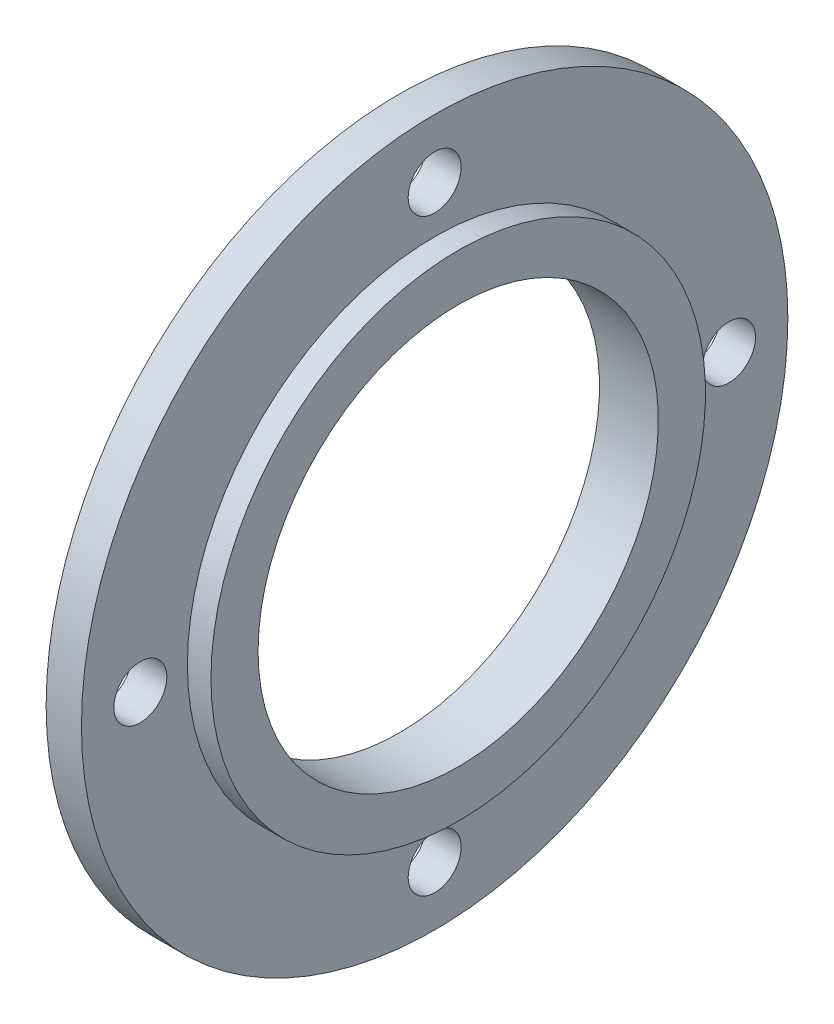
ISO-10303-21;
HEADER;
FILE_DESCRIPTION(('STEP AP214'),'2;1');
FILE_NAME('part.step','',(''),(''),'','','');
FILE_SCHEMA(('AUTOMOTIVE_DESIGN { 1 0 10303 214 1 1 1 1 }'));
ENDSEC;
DATA;
#1=APPLICATION_CONTEXT('core data for automotive mechanical design processes');
#2=APPLICATION_PROTOCOL_DEFINITION('international standard','automotive_design',2000,#1);
#3=PRODUCT_CONTEXT('',#1,'mechanical');
#4=PRODUCT('Part','Part','',(#3));
#5=PRODUCT_RELATED_PRODUCT_CATEGORY('part','',(#4));
#6=PRODUCT_DEFINITION_FORMATION('','',#4);
#7=PRODUCT_DEFINITION_CONTEXT('part definition',#1,'design');
#8=PRODUCT_DEFINITION('design','',#6,#7);
#9=PRODUCT_DEFINITION_SHAPE('','',#8);
#10=(LENGTH_UNIT() NAMED_UNIT(*) SI_UNIT(.MILLI.,.METRE.));
#11=(NAMED_UNIT(*) PLANE_ANGLE_UNIT() SI_UNIT($,.RADIAN.));
#12=(NAMED_UNIT(*) SI_UNIT($,.STERADIAN.) SOLID_ANGLE_UNIT());
#13=UNCERTAINTY_MEASURE_WITH_UNIT(LENGTH_MEASURE(1.E-05),#10,'distance_accuracy_value','');
#14=(GEOMETRIC_REPRESENTATION_CONTEXT(3) GLOBAL_UNCERTAINTY_ASSIGNED_CONTEXT((#13)) GLOBAL_UNIT_ASSIGNED_CONTEXT((#10,
#11,#12)) REPRESENTATION_CONTEXT('',''));
#15=CARTESIAN_POINT('',(0.,0.,0.));
#16=DIRECTION('',(0.,0.,1.));
#17=DIRECTION('',(1.,0.,0.));
#18=AXIS2_PLACEMENT_3D('',#15,#16,#17);
#19=CARTESIAN_POINT('',(0.,30.,0.));
#20=DIRECTION('',(1.,0.,0.));
#21=DIRECTION('',(0.,0.,-1.));
#22=AXIS2_PLACEMENT_3D('',#19,#20,#21);
#23=PLANE('',#22);
#24=CARTESIAN_POINT('',(0.,2.61861100413235E-13,25.));
#25=DIRECTION('',(-1.,0.,0.));
#26=DIRECTION('',(0.,0.,1.));
#27=AXIS2_PLACEMENT_3D('',#24,#25,#26);
#28=CIRCLE('',#27,2.25);
#29=CARTESIAN_POINT('',(0.,2.61861100413235E-13,27.25));
#30=VERTEX_POINT('',#29);
#31=EDGE_CURVE('E78',#30,#30,#28,.T.);
#32=ORIENTED_EDGE('',*,*,#31,.F.);
#33=EDGE_LOOP('',(#32));
#34=FACE_BOUND('',#33,.T.);
#35=CARTESIAN_POINT('',(0.,-25.,0.));
#36=DIRECTION('',(-1.,0.,0.));
#37=DIRECTION('',(0.,0.,1.));
#38=AXIS2_PLACEMENT_3D('',#35,#36,#37);
#39=CIRCLE('',#38,2.25);
#40=CARTESIAN_POINT('',(0.,-25.,2.25));
#41=VERTEX_POINT('',#40);
#42=EDGE_CURVE('E72',#41,#41,#39,.T.);
#43=ORIENTED_EDGE('',*,*,#42,.F.);
#44=EDGE_LOOP('',(#43));
#45=FACE_BOUND('',#44,.T.);
#46=CARTESIAN_POINT('',(0.,0.,-25.));
#47=DIRECTION('',(-1.,0.,0.));
#48=DIRECTION('',(0.,0.,1.));
#49=AXIS2_PLACEMENT_3D('',#46,#47,#48);
#50=CIRCLE('',#49,2.25);
#51=CARTESIAN_POINT('',(0.,0.,-22.75));
#52=VERTEX_POINT('',#51);
#53=EDGE_CURVE('E66',#52,#52,#50,.T.);
#54=ORIENTED_EDGE('',*,*,#53,.F.);
#55=EDGE_LOOP('',(#54));
#56=FACE_BOUND('',#55,.T.);
#57=CARTESIAN_POINT('',(0.,25.,0.));
#58=DIRECTION('',(-1.,0.,0.));
#59=DIRECTION('',(0.,0.,1.));
#60=AXIS2_PLACEMENT_3D('',#57,#58,#59);
#61=CIRCLE('',#60,2.25);
#62=CARTESIAN_POINT('',(0.,25.,2.25));
#63=VERTEX_POINT('',#62);
#64=EDGE_CURVE('E60',#63,#63,#61,.T.);
#65=ORIENTED_EDGE('',*,*,#64,.F.);
#66=EDGE_LOOP('',(#65));
#67=FACE_BOUND('',#66,.T.);
#68=CARTESIAN_POINT('',(0.,0.,0.));
#69=DIRECTION('',(-1.,0.,0.));
#70=DIRECTION('',(0.,0.,1.));
#71=AXIS2_PLACEMENT_3D('',#68,#69,#70);
#72=CIRCLE('',#71,17.);
#73=CARTESIAN_POINT('',(0.,0.,17.));
#74=VERTEX_POINT('',#73);
#75=EDGE_CURVE('E10',#74,#74,#72,.T.);
#76=ORIENTED_EDGE('',*,*,#75,.F.);
#77=EDGE_LOOP('',(#76));
#78=FACE_BOUND('',#77,.T.);
#79=CARTESIAN_POINT('',(0.,0.,0.));
#80=DIRECTION('',(-1.,0.,0.));
#81=DIRECTION('',(0.,0.,1.));
#82=AXIS2_PLACEMENT_3D('',#79,#80,#81);
#83=CIRCLE('',#82,30.);
#84=CARTESIAN_POINT('',(0.,0.,30.));
#85=VERTEX_POINT('',#84);
#86=EDGE_CURVE('E54',#85,#85,#83,.T.);
#87=ORIENTED_EDGE('',*,*,#86,.T.);
#88=EDGE_LOOP('',(#87));
#89=FACE_BOUND('',#88,.T.);
#90=ADVANCED_FACE('F32',(#34,#45,#56,#67,#78,#89),#23,.F.);
#91=CARTESIAN_POINT('',(0.,0.,0.));
#92=DIRECTION('',(-1.,0.,0.));
#93=DIRECTION('',(0.,0.,1.));
#94=AXIS2_PLACEMENT_3D('',#91,#92,#93);
#95=CYLINDRICAL_SURFACE('',#94,17.);
#96=CARTESIAN_POINT('',(5.,0.,0.));
#97=DIRECTION('',(-1.,0.,0.));
#98=DIRECTION('',(0.,0.,1.));
#99=AXIS2_PLACEMENT_3D('',#96,#97,#98);
#100=CIRCLE('',#99,17.);
#101=CARTESIAN_POINT('',(5.,0.,17.));
#102=VERTEX_POINT('',#101);
#103=EDGE_CURVE('E38',#102,#102,#100,.T.);
#104=ORIENTED_EDGE('',*,*,#103,.F.);
#105=EDGE_LOOP('',(#104));
#106=FACE_BOUND('',#105,.T.);
#107=ORIENTED_EDGE('',*,*,#75,.T.);
#108=EDGE_LOOP('',(#107));
#109=FACE_BOUND('',#108,.T.);
#110=ADVANCED_FACE('F86',(#106,#109),#95,.F.);
#111=CARTESIAN_POINT('',(5.,17.,0.));
#112=DIRECTION('',(-1.,0.,0.));
#113=DIRECTION('',(0.,0.,1.));
#114=AXIS2_PLACEMENT_3D('',#111,#112,#113);
#115=PLANE('',#114);
#116=CARTESIAN_POINT('',(5.,0.,0.));
#117=DIRECTION('',(-1.,0.,0.));
#118=DIRECTION('',(0.,0.,1.));
#119=AXIS2_PLACEMENT_3D('',#116,#117,#118);
#120=CIRCLE('',#119,21.);
#121=CARTESIAN_POINT('',(5.,0.,21.));
#122=VERTEX_POINT('',#121);
#123=EDGE_CURVE('E42',#122,#122,#120,.T.);
#124=ORIENTED_EDGE('',*,*,#123,.F.);
#125=EDGE_LOOP('',(#124));
#126=FACE_BOUND('',#125,.T.);
#127=ORIENTED_EDGE('',*,*,#103,.T.);
#128=EDGE_LOOP('',(#127));
#129=FACE_BOUND('',#128,.T.);
#130=ADVANCED_FACE('F113',(#126,#129),#115,.F.);
#131=CARTESIAN_POINT('',(0.,0.,0.));
#132=DIRECTION('',(-1.,0.,0.));
#133=DIRECTION('',(0.,0.,1.));
#134=AXIS2_PLACEMENT_3D('',#131,#132,#133);
#135=CYLINDRICAL_SURFACE('',#134,21.);
#136=CARTESIAN_POINT('',(3.,0.,0.));
#137=DIRECTION('',(-1.,0.,0.));
#138=DIRECTION('',(0.,0.,1.));
#139=AXIS2_PLACEMENT_3D('',#136,#137,#138);
#140=CIRCLE('',#139,21.);
#141=CARTESIAN_POINT('',(3.,0.,21.));
#142=VERTEX_POINT('',#141);
#143=EDGE_CURVE('E46',#142,#142,#140,.T.);
#144=ORIENTED_EDGE('',*,*,#143,.F.);
#145=EDGE_LOOP('',(#144));
#146=FACE_BOUND('',#145,.T.);
#147=ORIENTED_EDGE('',*,*,#123,.T.);
#148=EDGE_LOOP('',(#147));
#149=FACE_BOUND('',#148,.T.);
#150=ADVANCED_FACE('F106',(#146,#149),#135,.T.);
#151=CARTESIAN_POINT('',(3.,21.,0.));
#152=DIRECTION('',(-1.,0.,0.));
#153=DIRECTION('',(0.,0.,1.));
#154=AXIS2_PLACEMENT_3D('',#151,#152,#153);
#155=PLANE('',#154);
#156=CARTESIAN_POINT('',(3.,2.61861100413235E-13,25.));
#157=DIRECTION('',(-1.,0.,0.));
#158=DIRECTION('',(0.,0.,1.));
#159=AXIS2_PLACEMENT_3D('',#156,#157,#158);
#160=CIRCLE('',#159,2.25);
#161=CARTESIAN_POINT('',(3.,2.61861100413235E-13,27.25));
#162=VERTEX_POINT('',#161);
#163=EDGE_CURVE('E75',#162,#162,#160,.T.);
#164=ORIENTED_EDGE('',*,*,#163,.T.);
#165=EDGE_LOOP('',(#164));
#166=FACE_BOUND('',#165,.T.);
#167=CARTESIAN_POINT('',(3.,-25.,0.));
#168=DIRECTION('',(-1.,0.,0.));
#169=DIRECTION('',(0.,0.,1.));
#170=AXIS2_PLACEMENT_3D('',#167,#168,#169);
#171=CIRCLE('',#170,2.25);
#172=CARTESIAN_POINT('',(3.,-25.,2.25));
#173=VERTEX_POINT('',#172);
#174=EDGE_CURVE('E69',#173,#173,#171,.T.);
#175=ORIENTED_EDGE('',*,*,#174,.T.);
#176=EDGE_LOOP('',(#175));
#177=FACE_BOUND('',#176,.T.);
#178=CARTESIAN_POINT('',(3.,0.,-25.));
#179=DIRECTION('',(-1.,0.,0.));
#180=DIRECTION('',(0.,0.,1.));
#181=AXIS2_PLACEMENT_3D('',#178,#179,#180);
#182=CIRCLE('',#181,2.25);
#183=CARTESIAN_POINT('',(3.,0.,-22.75));
#184=VERTEX_POINT('',#183);
#185=EDGE_CURVE('E63',#184,#184,#182,.T.);
#186=ORIENTED_EDGE('',*,*,#185,.T.);
#187=EDGE_LOOP('',(#186));
#188=FACE_BOUND('',#187,.T.);
#189=CARTESIAN_POINT('',(3.,25.,0.));
#190=DIRECTION('',(-1.,0.,0.));
#191=DIRECTION('',(0.,0.,1.));
#192=AXIS2_PLACEMENT_3D('',#189,#190,#191);
#193=CIRCLE('',#192,2.25);
#194=CARTESIAN_POINT('',(3.,25.,2.25));
#195=VERTEX_POINT('',#194);
#196=EDGE_CURVE('E57',#195,#195,#193,.T.);
#197=ORIENTED_EDGE('',*,*,#196,.T.);
#198=EDGE_LOOP('',(#197));
#199=FACE_BOUND('',#198,.T.);
#200=CARTESIAN_POINT('',(3.,0.,0.));
#201=DIRECTION('',(-1.,0.,0.));
#202=DIRECTION('',(0.,0.,1.));
#203=AXIS2_PLACEMENT_3D('',#200,#201,#202);
#204=CIRCLE('',#203,30.);
#205=CARTESIAN_POINT('',(3.,0.,30.));
#206=VERTEX_POINT('',#205);
#207=EDGE_CURVE('E51',#206,#206,#204,.T.);
#208=ORIENTED_EDGE('',*,*,#207,.F.);
#209=EDGE_LOOP('',(#208));
#210=FACE_BOUND('',#209,.T.);
#211=ORIENTED_EDGE('',*,*,#143,.T.);
#212=EDGE_LOOP('',(#211));
#213=FACE_BOUND('',#212,.T.);
#214=ADVANCED_FACE('F100',(#166,#177,#188,#199,#210,#213),#155,.F.);
#215=CARTESIAN_POINT('',(0.,0.,0.));
#216=DIRECTION('',(-1.,0.,0.));
#217=DIRECTION('',(0.,0.,1.));
#218=AXIS2_PLACEMENT_3D('',#215,#216,#217);
#219=CYLINDRICAL_SURFACE('',#218,30.);
#220=ORIENTED_EDGE('',*,*,#86,.F.);
#221=EDGE_LOOP('',(#220));
#222=FACE_BOUND('',#221,.T.);
#223=ORIENTED_EDGE('',*,*,#207,.T.);
#224=EDGE_LOOP('',(#223));
#225=FACE_BOUND('',#224,.T.);
#226=ADVANCED_FACE('F96',(#222,#225),#219,.T.);
#227=CARTESIAN_POINT('',(0.,25.,0.));
#228=DIRECTION('',(-1.,0.,0.));
#229=DIRECTION('',(0.,0.,1.));
#230=AXIS2_PLACEMENT_3D('',#227,#228,#229);
#231=CYLINDRICAL_SURFACE('',#230,2.25);
#232=ORIENTED_EDGE('',*,*,#196,.F.);
#233=EDGE_LOOP('',(#232));
#234=FACE_BOUND('',#233,.T.);
#235=ORIENTED_EDGE('',*,*,#64,.T.);
#236=EDGE_LOOP('',(#235));
#237=FACE_BOUND('',#236,.T.);
#238=ADVANCED_FACE('F99',(#234,#237),#231,.F.);
#239=CARTESIAN_POINT('',(0.,0.,-25.));
#240=DIRECTION('',(-1.,0.,0.));
#241=DIRECTION('',(0.,0.,1.));
#242=AXIS2_PLACEMENT_3D('',#239,#240,#241);
#243=CYLINDRICAL_SURFACE('',#242,2.25);
#244=ORIENTED_EDGE('',*,*,#185,.F.);
#245=EDGE_LOOP('',(#244));
#246=FACE_BOUND('',#245,.T.);
#247=ORIENTED_EDGE('',*,*,#53,.T.);
#248=EDGE_LOOP('',(#247));
#249=FACE_BOUND('',#248,.T.);
#250=ADVANCED_FACE('F126',(#246,#249),#243,.F.);
#251=CARTESIAN_POINT('',(0.,-25.,0.));
#252=DIRECTION('',(-1.,0.,0.));
#253=DIRECTION('',(0.,0.,1.));
#254=AXIS2_PLACEMENT_3D('',#251,#252,#253);
#255=CYLINDRICAL_SURFACE('',#254,2.25);
#256=ORIENTED_EDGE('',*,*,#174,.F.);
#257=EDGE_LOOP('',(#256));
#258=FACE_BOUND('',#257,.T.);
#259=ORIENTED_EDGE('',*,*,#42,.T.);
#260=EDGE_LOOP('',(#259));
#261=FACE_BOUND('',#260,.T.);
#262=ADVANCED_FACE('F130',(#258,#261),#255,.F.);
#263=CARTESIAN_POINT('',(0.,2.61861100413235E-13,25.));
#264=DIRECTION('',(-1.,0.,0.));
#265=DIRECTION('',(0.,0.,1.));
#266=AXIS2_PLACEMENT_3D('',#263,#264,#265);
#267=CYLINDRICAL_SURFACE('',#266,2.25);
#268=ORIENTED_EDGE('',*,*,#163,.F.);
#269=EDGE_LOOP('',(#268));
#270=FACE_BOUND('',#269,.T.);
#271=ORIENTED_EDGE('',*,*,#31,.T.);
#272=EDGE_LOOP('',(#271));
#273=FACE_BOUND('',#272,.T.);
#274=ADVANCED_FACE('F82',(#270,#273),#267,.F.);
#275=CLOSED_SHELL('',(#90,#110,#130,#150,#214,#226,#238,#250,#262,#274));
#276=MANIFOLD_SOLID_BREP('B2',#275);
#277=ADVANCED_BREP_SHAPE_REPRESENTATION('',(#18,#276),#14);
#278=SHAPE_DEFINITION_REPRESENTATION(#9,#277);
ENDSEC;
END-ISO-10303-21;
